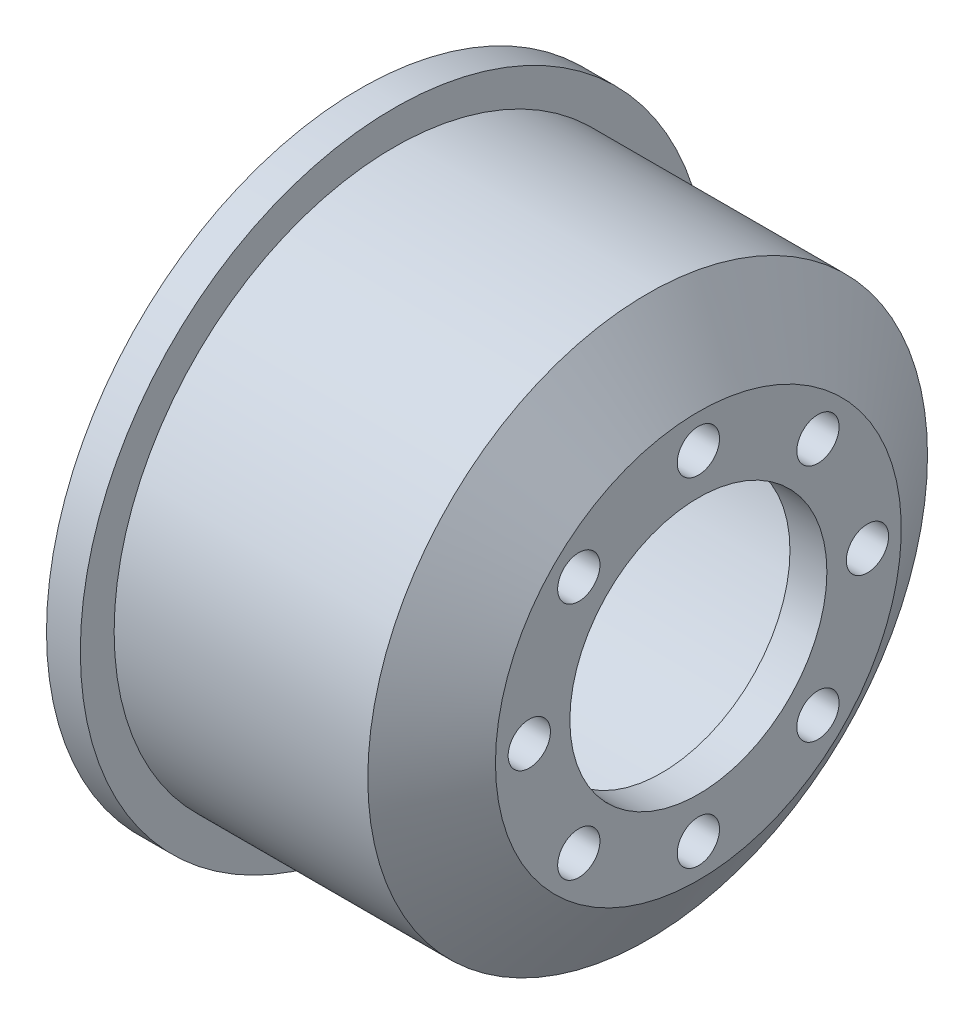
ISO-10303-21;
HEADER;
FILE_DESCRIPTION(('STEP AP214'),'2;1');
FILE_NAME('part.step','',(''),(''),'','','');
FILE_SCHEMA(('AUTOMOTIVE_DESIGN { 1 0 10303 214 1 1 1 1 }'));
ENDSEC;
DATA;
#1=APPLICATION_CONTEXT('core data for automotive mechanical design processes');
#2=APPLICATION_PROTOCOL_DEFINITION('international standard','automotive_design',2000,#1);
#3=PRODUCT_CONTEXT('',#1,'mechanical');
#4=PRODUCT('Part','Part','',(#3));
#5=PRODUCT_RELATED_PRODUCT_CATEGORY('part','',(#4));
#6=PRODUCT_DEFINITION_FORMATION('','',#4);
#7=PRODUCT_DEFINITION_CONTEXT('part definition',#1,'design');
#8=PRODUCT_DEFINITION('design','',#6,#7);
#9=PRODUCT_DEFINITION_SHAPE('','',#8);
#10=(LENGTH_UNIT() NAMED_UNIT(*) SI_UNIT(.MILLI.,.METRE.));
#11=(NAMED_UNIT(*) PLANE_ANGLE_UNIT() SI_UNIT($,.RADIAN.));
#12=(NAMED_UNIT(*) SI_UNIT($,.STERADIAN.) SOLID_ANGLE_UNIT());
#13=UNCERTAINTY_MEASURE_WITH_UNIT(LENGTH_MEASURE(1.E-05),#10,'distance_accuracy_value','');
#14=(GEOMETRIC_REPRESENTATION_CONTEXT(3) GLOBAL_UNCERTAINTY_ASSIGNED_CONTEXT((#13)) GLOBAL_UNIT_ASSIGNED_CONTEXT((#10,
#11,#12)) REPRESENTATION_CONTEXT('',''));
#15=CARTESIAN_POINT('',(0.,0.,0.));
#16=DIRECTION('',(0.,0.,1.));
#17=DIRECTION('',(1.,0.,0.));
#18=AXIS2_PLACEMENT_3D('',#15,#16,#17);
#19=CARTESIAN_POINT('',(-37.2788661687838,0.,0.));
#20=DIRECTION('',(-1.,0.,0.));
#21=DIRECTION('',(0.,0.,1.));
#22=AXIS2_PLACEMENT_3D('',#19,#20,#21);
#23=CYLINDRICAL_SURFACE('',#22,7.6);
#24=CARTESIAN_POINT('',(12.1398131593203,0.,0.));
#25=DIRECTION('',(-1.,0.,0.));
#26=DIRECTION('',(0.,0.,1.));
#27=AXIS2_PLACEMENT_3D('',#24,#25,#26);
#28=CIRCLE('',#27,7.6);
#29=CARTESIAN_POINT('',(12.1398131593203,0.,7.6));
#30=VERTEX_POINT('',#29);
#31=EDGE_CURVE('E10',#30,#30,#28,.T.);
#32=ORIENTED_EDGE('',*,*,#31,.F.);
#33=EDGE_LOOP('',(#32));
#34=FACE_BOUND('',#33,.T.);
#35=CARTESIAN_POINT('',(9.95647885253906,0.,0.));
#36=DIRECTION('',(-1.,0.,0.));
#37=DIRECTION('',(0.,0.,1.));
#38=AXIS2_PLACEMENT_3D('',#35,#36,#37);
#39=CIRCLE('',#38,7.6);
#40=CARTESIAN_POINT('',(9.95647885253906,0.,7.6));
#41=VERTEX_POINT('',#40);
#42=EDGE_CURVE('E72',#41,#41,#39,.T.);
#43=ORIENTED_EDGE('',*,*,#42,.T.);
#44=EDGE_LOOP('',(#43));
#45=FACE_BOUND('',#44,.T.);
#46=ADVANCED_FACE('F33',(#34,#45),#23,.F.);
#47=CARTESIAN_POINT('',(12.1398131593203,0.,-7.6));
#48=DIRECTION('',(-1.,0.,0.));
#49=DIRECTION('',(0.,0.,1.));
#50=AXIS2_PLACEMENT_3D('',#47,#48,#49);
#51=PLANE('',#50);
#52=CARTESIAN_POINT('',(12.1398131593203,10.,0.));
#53=DIRECTION('',(1.,0.,0.));
#54=DIRECTION('',(0.,0.,-1.));
#55=AXIS2_PLACEMENT_3D('',#52,#53,#54);
#56=CIRCLE('',#55,1.25);
#57=CARTESIAN_POINT('',(12.1398131593203,10.,-1.25));
#58=VERTEX_POINT('',#57);
#59=EDGE_CURVE('E53',#58,#58,#56,.T.);
#60=ORIENTED_EDGE('',*,*,#59,.F.);
#61=EDGE_LOOP('',(#60));
#62=FACE_BOUND('',#61,.T.);
#63=CARTESIAN_POINT('',(12.1398131593203,7.07106781186578,-7.0710678118656));
#64=DIRECTION('',(1.,0.,0.));
#65=DIRECTION('',(0.,0.,-1.));
#66=AXIS2_PLACEMENT_3D('',#63,#64,#65);
#67=CIRCLE('',#66,1.25000000000005);
#68=CARTESIAN_POINT('',(12.1398131593203,7.07106781186578,-8.32106781186565));
#69=VERTEX_POINT('',#68);
#70=EDGE_CURVE('E196',#69,#69,#67,.T.);
#71=ORIENTED_EDGE('',*,*,#70,.F.);
#72=EDGE_LOOP('',(#71));
#73=FACE_BOUND('',#72,.T.);
#74=CARTESIAN_POINT('',(12.1398131593203,4.24488671257339E-13,-10.0000000000004));
#75=DIRECTION('',(1.,0.,0.));
#76=DIRECTION('',(0.,0.,-1.));
#77=AXIS2_PLACEMENT_3D('',#74,#75,#76);
#78=CIRCLE('',#77,1.25000000000032);
#79=CARTESIAN_POINT('',(12.1398131593203,4.24488671257339E-13,-11.2500000000007));
#80=VERTEX_POINT('',#79);
#81=EDGE_CURVE('E199',#80,#80,#78,.T.);
#82=ORIENTED_EDGE('',*,*,#81,.F.);
#83=EDGE_LOOP('',(#82));
#84=FACE_BOUND('',#83,.T.);
#85=CARTESIAN_POINT('',(12.1398131593203,-7.07106781186517,-7.0710678118662));
#86=DIRECTION('',(1.,0.,0.));
#87=DIRECTION('',(0.,0.,-1.));
#88=AXIS2_PLACEMENT_3D('',#85,#86,#87);
#89=CIRCLE('',#88,1.25000000000066);
#90=CARTESIAN_POINT('',(12.1398131593203,-7.07106781186517,-8.32106781186686));
#91=VERTEX_POINT('',#90);
#92=EDGE_CURVE('E204',#91,#91,#89,.T.);
#93=ORIENTED_EDGE('',*,*,#92,.F.);
#94=EDGE_LOOP('',(#93));
#95=FACE_BOUND('',#94,.T.);
#96=CARTESIAN_POINT('',(12.1398131593203,-10.,-8.48977342514678E-13));
#97=DIRECTION('',(1.,0.,0.));
#98=DIRECTION('',(0.,0.,-1.));
#99=AXIS2_PLACEMENT_3D('',#96,#97,#98);
#100=CIRCLE('',#99,1.25000000000088);
#101=CARTESIAN_POINT('',(12.1398131593203,-10.,-1.25000000000173));
#102=VERTEX_POINT('',#101);
#103=EDGE_CURVE('E207',#102,#102,#100,.T.);
#104=ORIENTED_EDGE('',*,*,#103,.F.);
#105=EDGE_LOOP('',(#104));
#106=FACE_BOUND('',#105,.T.);
#107=CARTESIAN_POINT('',(12.1398131593203,-7.07106781186578,7.07106781186475));
#108=DIRECTION('',(1.,0.,0.));
#109=DIRECTION('',(0.,0.,-1.));
#110=AXIS2_PLACEMENT_3D('',#107,#108,#109);
#111=CIRCLE('',#110,1.25000000000086);
#112=CARTESIAN_POINT('',(12.1398131593203,-7.07106781186578,5.82106781186389));
#113=VERTEX_POINT('',#112);
#114=EDGE_CURVE('E210',#113,#113,#111,.T.);
#115=ORIENTED_EDGE('',*,*,#114,.F.);
#116=EDGE_LOOP('',(#115));
#117=FACE_BOUND('',#116,.T.);
#118=CARTESIAN_POINT('',(12.1398131593203,-4.25713318056486E-13,9.99999999999958));
#119=DIRECTION('',(1.,0.,0.));
#120=DIRECTION('',(0.,0.,-1.));
#121=AXIS2_PLACEMENT_3D('',#118,#119,#120);
#122=CIRCLE('',#121,1.25000000000063);
#123=CARTESIAN_POINT('',(12.1398131593203,-4.25713318056486E-13,8.74999999999895));
#124=VERTEX_POINT('',#123);
#125=EDGE_CURVE('E212',#124,#124,#122,.T.);
#126=ORIENTED_EDGE('',*,*,#125,.F.);
#127=EDGE_LOOP('',(#126));
#128=FACE_BOUND('',#127,.T.);
#129=CARTESIAN_POINT('',(12.1398131593203,7.07106781186517,7.07106781186535));
#130=DIRECTION('',(1.,0.,0.));
#131=DIRECTION('',(0.,0.,-1.));
#132=AXIS2_PLACEMENT_3D('',#129,#130,#131);
#133=CIRCLE('',#132,1.25000000000032);
#134=CARTESIAN_POINT('',(12.1398131593203,7.07106781186517,5.82106781186503));
#135=VERTEX_POINT('',#134);
#136=EDGE_CURVE('E84',#135,#135,#133,.T.);
#137=ORIENTED_EDGE('',*,*,#136,.F.);
#138=EDGE_LOOP('',(#137));
#139=FACE_BOUND('',#138,.T.);
#140=CARTESIAN_POINT('',(12.1398131593203,0.,0.));
#141=DIRECTION('',(-1.,0.,0.));
#142=DIRECTION('',(0.,0.,1.));
#143=AXIS2_PLACEMENT_3D('',#140,#141,#142);
#144=CIRCLE('',#143,12.);
#145=CARTESIAN_POINT('',(12.1398131593203,0.,12.));
#146=VERTEX_POINT('',#145);
#147=EDGE_CURVE('E40',#146,#146,#144,.T.);
#148=ORIENTED_EDGE('',*,*,#147,.F.);
#149=EDGE_LOOP('',(#148));
#150=FACE_BOUND('',#149,.T.);
#151=ORIENTED_EDGE('',*,*,#31,.T.);
#152=EDGE_LOOP('',(#151));
#153=FACE_BOUND('',#152,.T.);
#154=ADVANCED_FACE('F114',(#62,#73,#84,#95,#106,#117,#128,#139,#150,#153),#51,.F.);
#155=CARTESIAN_POINT('',(12.1398131593203,0.,0.));
#156=DIRECTION('',(-1.,0.,0.));
#157=DIRECTION('',(0.,0.,1.));
#158=AXIS2_PLACEMENT_3D('',#155,#156,#157);
#159=CONICAL_SURFACE('',#158,12.,0.987882737839164);
#160=CARTESIAN_POINT('',(9.1398131593203,0.,0.));
#161=DIRECTION('',(-1.,0.,0.));
#162=DIRECTION('',(0.,0.,1.));
#163=AXIS2_PLACEMENT_3D('',#160,#161,#162);
#164=CIRCLE('',#163,16.55);
#165=CARTESIAN_POINT('',(9.1398131593203,0.,16.55));
#166=VERTEX_POINT('',#165);
#167=EDGE_CURVE('E45',#166,#166,#164,.T.);
#168=ORIENTED_EDGE('',*,*,#167,.F.);
#169=EDGE_LOOP('',(#168));
#170=FACE_BOUND('',#169,.T.);
#171=ORIENTED_EDGE('',*,*,#147,.T.);
#172=EDGE_LOOP('',(#171));
#173=FACE_BOUND('',#172,.T.);
#174=ADVANCED_FACE('F111',(#170,#173),#159,.T.);
#175=CARTESIAN_POINT('',(-37.2788661687838,0.,0.));
#176=DIRECTION('',(-1.,0.,0.));
#177=DIRECTION('',(0.,0.,1.));
#178=AXIS2_PLACEMENT_3D('',#175,#176,#177);
#179=CYLINDRICAL_SURFACE('',#178,16.55);
#180=CARTESIAN_POINT('',(-5.86018684067971,0.,0.));
#181=DIRECTION('',(-1.,0.,0.));
#182=DIRECTION('',(0.,0.,1.));
#183=AXIS2_PLACEMENT_3D('',#180,#181,#182);
#184=CIRCLE('',#183,16.55);
#185=CARTESIAN_POINT('',(-5.86018684067971,0.,16.55));
#186=VERTEX_POINT('',#185);
#187=EDGE_CURVE('E104',#186,#186,#184,.T.);
#188=ORIENTED_EDGE('',*,*,#187,.F.);
#189=EDGE_LOOP('',(#188));
#190=FACE_BOUND('',#189,.T.);
#191=ORIENTED_EDGE('',*,*,#167,.T.);
#192=EDGE_LOOP('',(#191));
#193=FACE_BOUND('',#192,.T.);
#194=ADVANCED_FACE('F109',(#190,#193),#179,.T.);
#195=CARTESIAN_POINT('',(-5.86018684067971,0.,-18.55));
#196=DIRECTION('',(-1.,0.,0.));
#197=DIRECTION('',(0.,0.,1.));
#198=AXIS2_PLACEMENT_3D('',#195,#196,#197);
#199=PLANE('',#198);
#200=CARTESIAN_POINT('',(-5.86018684067971,0.,0.));
#201=DIRECTION('',(-1.,0.,0.));
#202=DIRECTION('',(0.,0.,1.));
#203=AXIS2_PLACEMENT_3D('',#200,#201,#202);
#204=CIRCLE('',#203,18.55);
#205=CARTESIAN_POINT('',(-5.86018684067971,0.,18.55));
#206=VERTEX_POINT('',#205);
#207=EDGE_CURVE('E101',#206,#206,#204,.T.);
#208=ORIENTED_EDGE('',*,*,#207,.F.);
#209=EDGE_LOOP('',(#208));
#210=FACE_BOUND('',#209,.T.);
#211=ORIENTED_EDGE('',*,*,#187,.T.);
#212=EDGE_LOOP('',(#211));
#213=FACE_BOUND('',#212,.T.);
#214=ADVANCED_FACE('F129',(#210,#213),#199,.F.);
#215=CARTESIAN_POINT('',(-37.2788661687838,0.,0.));
#216=DIRECTION('',(-1.,0.,0.));
#217=DIRECTION('',(0.,0.,1.));
#218=AXIS2_PLACEMENT_3D('',#215,#216,#217);
#219=CYLINDRICAL_SURFACE('',#218,18.55);
#220=CARTESIAN_POINT('',(-7.86018684067971,0.,0.));
#221=DIRECTION('',(-1.,0.,0.));
#222=DIRECTION('',(0.,0.,1.));
#223=AXIS2_PLACEMENT_3D('',#220,#221,#222);
#224=CIRCLE('',#223,18.55);
#225=CARTESIAN_POINT('',(-7.86018684067971,0.,18.55));
#226=VERTEX_POINT('',#225);
#227=EDGE_CURVE('E98',#226,#226,#224,.T.);
#228=ORIENTED_EDGE('',*,*,#227,.F.);
#229=EDGE_LOOP('',(#228));
#230=FACE_BOUND('',#229,.T.);
#231=ORIENTED_EDGE('',*,*,#207,.T.);
#232=EDGE_LOOP('',(#231));
#233=FACE_BOUND('',#232,.T.);
#234=ADVANCED_FACE('F133',(#230,#233),#219,.T.);
#235=CARTESIAN_POINT('',(-7.86018684067971,0.,-18.55));
#236=DIRECTION('',(1.,0.,0.));
#237=DIRECTION('',(0.,0.,-1.));
#238=AXIS2_PLACEMENT_3D('',#235,#236,#237);
#239=PLANE('',#238);
#240=CARTESIAN_POINT('',(-7.86018684067971,0.,0.));
#241=DIRECTION('',(-1.,0.,0.));
#242=DIRECTION('',(0.,0.,1.));
#243=AXIS2_PLACEMENT_3D('',#240,#241,#242);
#244=CIRCLE('',#243,17.55);
#245=CARTESIAN_POINT('',(-7.86018684067971,0.,17.55));
#246=VERTEX_POINT('',#245);
#247=EDGE_CURVE('E95',#246,#246,#244,.T.);
#248=ORIENTED_EDGE('',*,*,#247,.F.);
#249=EDGE_LOOP('',(#248));
#250=FACE_BOUND('',#249,.T.);
#251=ORIENTED_EDGE('',*,*,#227,.T.);
#252=EDGE_LOOP('',(#251));
#253=FACE_BOUND('',#252,.T.);
#254=ADVANCED_FACE('F137',(#250,#253),#239,.F.);
#255=CARTESIAN_POINT('',(-37.2788661687838,0.,0.));
#256=DIRECTION('',(-1.,0.,0.));
#257=DIRECTION('',(0.,0.,1.));
#258=AXIS2_PLACEMENT_3D('',#255,#256,#257);
#259=CYLINDRICAL_SURFACE('',#258,17.55);
#260=CARTESIAN_POINT('',(-7.36018684067971,0.,0.));
#261=DIRECTION('',(-1.,0.,0.));
#262=DIRECTION('',(0.,0.,1.));
#263=AXIS2_PLACEMENT_3D('',#260,#261,#262);
#264=CIRCLE('',#263,17.55);
#265=CARTESIAN_POINT('',(-7.36018684067971,0.,17.55));
#266=VERTEX_POINT('',#265);
#267=EDGE_CURVE('E92',#266,#266,#264,.T.);
#268=ORIENTED_EDGE('',*,*,#267,.F.);
#269=EDGE_LOOP('',(#268));
#270=FACE_BOUND('',#269,.T.);
#271=ORIENTED_EDGE('',*,*,#247,.T.);
#272=EDGE_LOOP('',(#271));
#273=FACE_BOUND('',#272,.T.);
#274=ADVANCED_FACE('F141',(#270,#273),#259,.F.);
#275=CARTESIAN_POINT('',(-7.36018684067971,0.,-14.55));
#276=DIRECTION('',(1.,0.,0.));
#277=DIRECTION('',(0.,0.,-1.));
#278=AXIS2_PLACEMENT_3D('',#275,#276,#277);
#279=PLANE('',#278);
#280=CARTESIAN_POINT('',(-7.36018684067971,0.,0.));
#281=DIRECTION('',(-1.,0.,0.));
#282=DIRECTION('',(0.,0.,1.));
#283=AXIS2_PLACEMENT_3D('',#280,#281,#282);
#284=CIRCLE('',#283,14.55);
#285=CARTESIAN_POINT('',(-7.36018684067971,0.,14.55));
#286=VERTEX_POINT('',#285);
#287=EDGE_CURVE('E89',#286,#286,#284,.T.);
#288=ORIENTED_EDGE('',*,*,#287,.F.);
#289=EDGE_LOOP('',(#288));
#290=FACE_BOUND('',#289,.T.);
#291=ORIENTED_EDGE('',*,*,#267,.T.);
#292=EDGE_LOOP('',(#291));
#293=FACE_BOUND('',#292,.T.);
#294=ADVANCED_FACE('F145',(#290,#293),#279,.F.);
#295=CARTESIAN_POINT('',(-37.2788661687838,0.,0.));
#296=DIRECTION('',(-1.,0.,0.));
#297=DIRECTION('',(0.,0.,1.));
#298=AXIS2_PLACEMENT_3D('',#295,#296,#297);
#299=CYLINDRICAL_SURFACE('',#298,14.55);
#300=CARTESIAN_POINT('',(7.87031022140543,0.,0.));
#301=DIRECTION('',(-1.,0.,0.));
#302=DIRECTION('',(0.,0.,1.));
#303=AXIS2_PLACEMENT_3D('',#300,#301,#302);
#304=CIRCLE('',#303,14.55);
#305=CARTESIAN_POINT('',(7.87031022140543,0.,14.55));
#306=VERTEX_POINT('',#305);
#307=EDGE_CURVE('E81',#306,#306,#304,.T.);
#308=ORIENTED_EDGE('',*,*,#307,.F.);
#309=EDGE_LOOP('',(#308));
#310=FACE_BOUND('',#309,.T.);
#311=ORIENTED_EDGE('',*,*,#287,.T.);
#312=EDGE_LOOP('',(#311));
#313=FACE_BOUND('',#312,.T.);
#314=ADVANCED_FACE('F149',(#310,#313),#299,.F.);
#315=CARTESIAN_POINT('',(7.87031022140543,0.,0.));
#316=DIRECTION('',(-1.,0.,0.));
#317=DIRECTION('',(0.,0.,1.));
#318=AXIS2_PLACEMENT_3D('',#315,#316,#317);
#319=CONICAL_SURFACE('',#318,14.55,0.987882737839163);
#320=CARTESIAN_POINT('',(9.95647885253906,0.,0.));
#321=DIRECTION('',(-1.,0.,0.));
#322=DIRECTION('',(0.,0.,1.));
#323=AXIS2_PLACEMENT_3D('',#320,#321,#322);
#324=CIRCLE('',#323,11.385977576114);
#325=CARTESIAN_POINT('',(9.95647885253906,0.,11.385977576114));
#326=VERTEX_POINT('',#325);
#327=EDGE_CURVE('E76',#326,#326,#324,.T.);
#328=ORIENTED_EDGE('',*,*,#327,.F.);
#329=EDGE_LOOP('',(#328));
#330=FACE_BOUND('',#329,.T.);
#331=ORIENTED_EDGE('',*,*,#307,.T.);
#332=EDGE_LOOP('',(#331));
#333=FACE_BOUND('',#332,.T.);
#334=ADVANCED_FACE('F153',(#330,#333),#319,.F.);
#335=CARTESIAN_POINT('',(9.95647885253906,0.,-11.385977576114));
#336=DIRECTION('',(1.,0.,0.));
#337=DIRECTION('',(0.,0.,-1.));
#338=AXIS2_PLACEMENT_3D('',#335,#336,#337);
#339=PLANE('',#338);
#340=CARTESIAN_POINT('',(9.95647885253906,10.,0.));
#341=DIRECTION('',(1.,0.,0.));
#342=DIRECTION('',(0.,0.,-1.));
#343=AXIS2_PLACEMENT_3D('',#340,#341,#342);
#344=CIRCLE('',#343,1.25);
#345=CARTESIAN_POINT('',(9.95647885253906,10.,-1.25));
#346=VERTEX_POINT('',#345);
#347=EDGE_CURVE('E36',#346,#346,#344,.T.);
#348=ORIENTED_EDGE('',*,*,#347,.T.);
#349=EDGE_LOOP('',(#348));
#350=FACE_BOUND('',#349,.T.);
#351=CARTESIAN_POINT('',(9.95647885253906,7.07106781186578,-7.0710678118656));
#352=DIRECTION('',(1.,0.,0.));
#353=DIRECTION('',(0.,0.,-1.));
#354=AXIS2_PLACEMENT_3D('',#351,#352,#353);
#355=CIRCLE('',#354,1.25000000000005);
#356=CARTESIAN_POINT('',(9.95647885253906,7.07106781186578,-8.32106781186565));
#357=VERTEX_POINT('',#356);
#358=EDGE_CURVE('E67',#357,#357,#355,.T.);
#359=ORIENTED_EDGE('',*,*,#358,.T.);
#360=EDGE_LOOP('',(#359));
#361=FACE_BOUND('',#360,.T.);
#362=CARTESIAN_POINT('',(9.95647885253906,4.24488671257339E-13,-10.0000000000004));
#363=DIRECTION('',(1.,0.,0.));
#364=DIRECTION('',(0.,0.,-1.));
#365=AXIS2_PLACEMENT_3D('',#362,#363,#364);
#366=CIRCLE('',#365,1.25000000000032);
#367=CARTESIAN_POINT('',(9.95647885253906,4.24488671257339E-13,-11.2500000000007));
#368=VERTEX_POINT('',#367);
#369=EDGE_CURVE('E65',#368,#368,#366,.T.);
#370=ORIENTED_EDGE('',*,*,#369,.T.);
#371=EDGE_LOOP('',(#370));
#372=FACE_BOUND('',#371,.T.);
#373=CARTESIAN_POINT('',(9.95647885253906,-7.07106781186517,-7.0710678118662));
#374=DIRECTION('',(1.,0.,0.));
#375=DIRECTION('',(0.,0.,-1.));
#376=AXIS2_PLACEMENT_3D('',#373,#374,#375);
#377=CIRCLE('',#376,1.25000000000066);
#378=CARTESIAN_POINT('',(9.95647885253906,-7.07106781186517,-8.32106781186686));
#379=VERTEX_POINT('',#378);
#380=EDGE_CURVE('E62',#379,#379,#377,.T.);
#381=ORIENTED_EDGE('',*,*,#380,.T.);
#382=EDGE_LOOP('',(#381));
#383=FACE_BOUND('',#382,.T.);
#384=CARTESIAN_POINT('',(9.95647885253906,-10.,-8.48977342514678E-13));
#385=DIRECTION('',(1.,0.,0.));
#386=DIRECTION('',(0.,0.,-1.));
#387=AXIS2_PLACEMENT_3D('',#384,#385,#386);
#388=CIRCLE('',#387,1.25000000000088);
#389=CARTESIAN_POINT('',(9.95647885253906,-10.,-1.25000000000173));
#390=VERTEX_POINT('',#389);
#391=EDGE_CURVE('E59',#390,#390,#388,.T.);
#392=ORIENTED_EDGE('',*,*,#391,.T.);
#393=EDGE_LOOP('',(#392));
#394=FACE_BOUND('',#393,.T.);
#395=CARTESIAN_POINT('',(9.95647885253906,-7.07106781186578,7.07106781186475));
#396=DIRECTION('',(1.,0.,0.));
#397=DIRECTION('',(0.,0.,-1.));
#398=AXIS2_PLACEMENT_3D('',#395,#396,#397);
#399=CIRCLE('',#398,1.25000000000086);
#400=CARTESIAN_POINT('',(9.95647885253906,-7.07106781186578,5.82106781186389));
#401=VERTEX_POINT('',#400);
#402=EDGE_CURVE('E56',#401,#401,#399,.T.);
#403=ORIENTED_EDGE('',*,*,#402,.T.);
#404=EDGE_LOOP('',(#403));
#405=FACE_BOUND('',#404,.T.);
#406=CARTESIAN_POINT('',(9.95647885253906,-4.25713318056486E-13,9.99999999999958));
#407=DIRECTION('',(1.,0.,0.));
#408=DIRECTION('',(0.,0.,-1.));
#409=AXIS2_PLACEMENT_3D('',#406,#407,#408);
#410=CIRCLE('',#409,1.25000000000063);
#411=CARTESIAN_POINT('',(9.95647885253906,-4.25713318056486E-13,8.74999999999895));
#412=VERTEX_POINT('',#411);
#413=EDGE_CURVE('E52',#412,#412,#410,.T.);
#414=ORIENTED_EDGE('',*,*,#413,.T.);
#415=EDGE_LOOP('',(#414));
#416=FACE_BOUND('',#415,.T.);
#417=CARTESIAN_POINT('',(9.95647885253906,7.07106781186517,7.07106781186535));
#418=DIRECTION('',(1.,0.,0.));
#419=DIRECTION('',(0.,0.,-1.));
#420=AXIS2_PLACEMENT_3D('',#417,#418,#419);
#421=CIRCLE('',#420,1.25000000000032);
#422=CARTESIAN_POINT('',(9.95647885253906,7.07106781186517,5.82106781186503));
#423=VERTEX_POINT('',#422);
#424=EDGE_CURVE('E49',#423,#423,#421,.T.);
#425=ORIENTED_EDGE('',*,*,#424,.T.);
#426=EDGE_LOOP('',(#425));
#427=FACE_BOUND('',#426,.T.);
#428=ORIENTED_EDGE('',*,*,#42,.F.);
#429=EDGE_LOOP('',(#428));
#430=FACE_BOUND('',#429,.T.);
#431=ORIENTED_EDGE('',*,*,#327,.T.);
#432=EDGE_LOOP('',(#431));
#433=FACE_BOUND('',#432,.T.);
#434=ADVANCED_FACE('F157',(#350,#361,#372,#383,#394,#405,#416,#427,#430,#433),#339,.F.);
#435=CARTESIAN_POINT('',(-7.86018684067971,7.07106781186517,7.07106781186535));
#436=DIRECTION('',(1.,0.,0.));
#437=DIRECTION('',(0.,0.,-1.));
#438=AXIS2_PLACEMENT_3D('',#435,#436,#437);
#439=CYLINDRICAL_SURFACE('',#438,1.25000000000032);
#440=ORIENTED_EDGE('',*,*,#136,.T.);
#441=EDGE_LOOP('',(#440));
#442=FACE_BOUND('',#441,.T.);
#443=ORIENTED_EDGE('',*,*,#424,.F.);
#444=EDGE_LOOP('',(#443));
#445=FACE_BOUND('',#444,.T.);
#446=ADVANCED_FACE('F161',(#442,#445),#439,.F.);
#447=CARTESIAN_POINT('',(-7.86018684067971,-4.25713318056486E-13,9.99999999999958));
#448=DIRECTION('',(1.,0.,0.));
#449=DIRECTION('',(0.,0.,-1.));
#450=AXIS2_PLACEMENT_3D('',#447,#448,#449);
#451=CYLINDRICAL_SURFACE('',#450,1.25000000000063);
#452=ORIENTED_EDGE('',*,*,#125,.T.);
#453=EDGE_LOOP('',(#452));
#454=FACE_BOUND('',#453,.T.);
#455=ORIENTED_EDGE('',*,*,#413,.F.);
#456=EDGE_LOOP('',(#455));
#457=FACE_BOUND('',#456,.T.);
#458=ADVANCED_FACE('F164',(#454,#457),#451,.F.);
#459=CARTESIAN_POINT('',(-7.86018684067971,-7.07106781186578,7.07106781186475));
#460=DIRECTION('',(1.,0.,0.));
#461=DIRECTION('',(0.,0.,-1.));
#462=AXIS2_PLACEMENT_3D('',#459,#460,#461);
#463=CYLINDRICAL_SURFACE('',#462,1.25000000000086);
#464=ORIENTED_EDGE('',*,*,#114,.T.);
#465=EDGE_LOOP('',(#464));
#466=FACE_BOUND('',#465,.T.);
#467=ORIENTED_EDGE('',*,*,#402,.F.);
#468=EDGE_LOOP('',(#467));
#469=FACE_BOUND('',#468,.T.);
#470=ADVANCED_FACE('F168',(#466,#469),#463,.F.);
#471=CARTESIAN_POINT('',(-7.86018684067971,-10.,-8.48977342514678E-13));
#472=DIRECTION('',(1.,0.,0.));
#473=DIRECTION('',(0.,0.,-1.));
#474=AXIS2_PLACEMENT_3D('',#471,#472,#473);
#475=CYLINDRICAL_SURFACE('',#474,1.25000000000088);
#476=ORIENTED_EDGE('',*,*,#103,.T.);
#477=EDGE_LOOP('',(#476));
#478=FACE_BOUND('',#477,.T.);
#479=ORIENTED_EDGE('',*,*,#391,.F.);
#480=EDGE_LOOP('',(#479));
#481=FACE_BOUND('',#480,.T.);
#482=ADVANCED_FACE('F172',(#478,#481),#475,.F.);
#483=CARTESIAN_POINT('',(-7.86018684067971,-7.07106781186517,-7.0710678118662));
#484=DIRECTION('',(1.,0.,0.));
#485=DIRECTION('',(0.,0.,-1.));
#486=AXIS2_PLACEMENT_3D('',#483,#484,#485);
#487=CYLINDRICAL_SURFACE('',#486,1.25000000000066);
#488=ORIENTED_EDGE('',*,*,#92,.T.);
#489=EDGE_LOOP('',(#488));
#490=FACE_BOUND('',#489,.T.);
#491=ORIENTED_EDGE('',*,*,#380,.F.);
#492=EDGE_LOOP('',(#491));
#493=FACE_BOUND('',#492,.T.);
#494=ADVANCED_FACE('F176',(#490,#493),#487,.F.);
#495=CARTESIAN_POINT('',(-7.86018684067971,4.24488671257339E-13,-10.0000000000004));
#496=DIRECTION('',(1.,0.,0.));
#497=DIRECTION('',(0.,0.,-1.));
#498=AXIS2_PLACEMENT_3D('',#495,#496,#497);
#499=CYLINDRICAL_SURFACE('',#498,1.25000000000032);
#500=ORIENTED_EDGE('',*,*,#81,.T.);
#501=EDGE_LOOP('',(#500));
#502=FACE_BOUND('',#501,.T.);
#503=ORIENTED_EDGE('',*,*,#369,.F.);
#504=EDGE_LOOP('',(#503));
#505=FACE_BOUND('',#504,.T.);
#506=ADVANCED_FACE('F180',(#502,#505),#499,.F.);
#507=CARTESIAN_POINT('',(-7.86018684067971,7.07106781186578,-7.0710678118656));
#508=DIRECTION('',(1.,0.,0.));
#509=DIRECTION('',(0.,0.,-1.));
#510=AXIS2_PLACEMENT_3D('',#507,#508,#509);
#511=CYLINDRICAL_SURFACE('',#510,1.25000000000005);
#512=ORIENTED_EDGE('',*,*,#70,.T.);
#513=EDGE_LOOP('',(#512));
#514=FACE_BOUND('',#513,.T.);
#515=ORIENTED_EDGE('',*,*,#358,.F.);
#516=EDGE_LOOP('',(#515));
#517=FACE_BOUND('',#516,.T.);
#518=ADVANCED_FACE('F184',(#514,#517),#511,.F.);
#519=CARTESIAN_POINT('',(-7.86018684067971,10.,0.));
#520=DIRECTION('',(1.,0.,0.));
#521=DIRECTION('',(0.,0.,-1.));
#522=AXIS2_PLACEMENT_3D('',#519,#520,#521);
#523=CYLINDRICAL_SURFACE('',#522,1.25);
#524=ORIENTED_EDGE('',*,*,#59,.T.);
#525=EDGE_LOOP('',(#524));
#526=FACE_BOUND('',#525,.T.);
#527=ORIENTED_EDGE('',*,*,#347,.F.);
#528=EDGE_LOOP('',(#527));
#529=FACE_BOUND('',#528,.T.);
#530=ADVANCED_FACE('F188',(#526,#529),#523,.F.);
#531=CLOSED_SHELL('',(#46,#154,#174,#194,#214,#234,#254,#274,#294,#314,#334,#434,#446,#458,#470,
#482,#494,#506,#518,#530));
#532=MANIFOLD_SOLID_BREP('B2',#531);
#533=ADVANCED_BREP_SHAPE_REPRESENTATION('',(#18,#532),#14);
#534=SHAPE_DEFINITION_REPRESENTATION(#9,#533);
ENDSEC;
END-ISO-10303-21;
